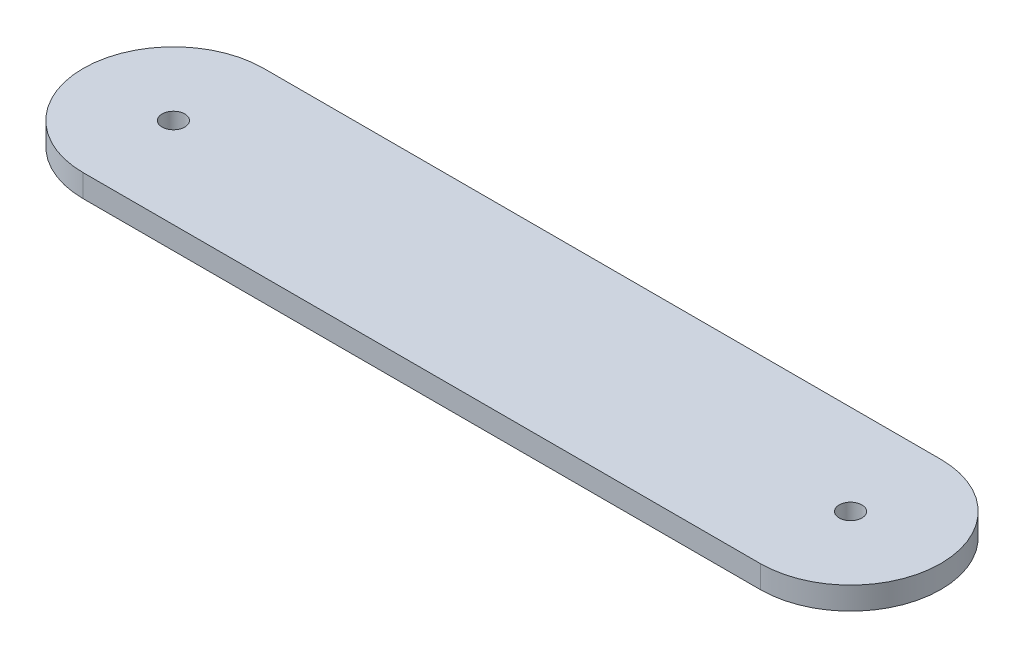
ISO-10303-21;
HEADER;
FILE_DESCRIPTION(('STEP AP214'),'2;1');
FILE_NAME('part.step','',(''),(''),'','','');
FILE_SCHEMA(('AUTOMOTIVE_DESIGN { 1 0 10303 214 1 1 1 1 }'));
ENDSEC;
DATA;
#1=APPLICATION_CONTEXT('core data for automotive mechanical design processes');
#2=APPLICATION_PROTOCOL_DEFINITION('international standard','automotive_design',2000,#1);
#3=PRODUCT_CONTEXT('',#1,'mechanical');
#4=PRODUCT('Part','Part','',(#3));
#5=PRODUCT_RELATED_PRODUCT_CATEGORY('part','',(#4));
#6=PRODUCT_DEFINITION_FORMATION('','',#4);
#7=PRODUCT_DEFINITION_CONTEXT('part definition',#1,'design');
#8=PRODUCT_DEFINITION('design','',#6,#7);
#9=PRODUCT_DEFINITION_SHAPE('','',#8);
#10=(LENGTH_UNIT() NAMED_UNIT(*) SI_UNIT(.MILLI.,.METRE.));
#11=(NAMED_UNIT(*) PLANE_ANGLE_UNIT() SI_UNIT($,.RADIAN.));
#12=(NAMED_UNIT(*) SI_UNIT($,.STERADIAN.) SOLID_ANGLE_UNIT());
#13=UNCERTAINTY_MEASURE_WITH_UNIT(LENGTH_MEASURE(1.E-05),#10,'distance_accuracy_value','');
#14=(GEOMETRIC_REPRESENTATION_CONTEXT(3) GLOBAL_UNCERTAINTY_ASSIGNED_CONTEXT((#13)) GLOBAL_UNIT_ASSIGNED_CONTEXT((#10,
#11,#12)) REPRESENTATION_CONTEXT('',''));
#15=CARTESIAN_POINT('',(0.,0.,0.));
#16=DIRECTION('',(0.,0.,1.));
#17=DIRECTION('',(1.,0.,0.));
#18=AXIS2_PLACEMENT_3D('',#15,#16,#17);
#19=CARTESIAN_POINT('',(-47.625,3.175,0.));
#20=DIRECTION('',(0.,-1.,0.));
#21=DIRECTION('',(0.,0.,-1.));
#22=AXIS2_PLACEMENT_3D('',#19,#20,#21);
#23=CYLINDRICAL_SURFACE('',#22,12.7);
#24=CARTESIAN_POINT('',(-47.625,0.,0.));
#25=DIRECTION('',(0.,1.,0.));
#26=DIRECTION('',(0.,0.,1.));
#27=AXIS2_PLACEMENT_3D('',#24,#25,#26);
#28=CIRCLE('',#27,12.7);
#29=CARTESIAN_POINT('',(-47.625,0.,-12.7));
#30=VERTEX_POINT('',#29);
#31=CARTESIAN_POINT('',(-47.625,0.,12.7));
#32=VERTEX_POINT('',#31);
#33=EDGE_CURVE('E96',#30,#32,#28,.T.);
#34=ORIENTED_EDGE('',*,*,#33,.T.);
#35=DIRECTION('',(0.,-1.,0.));
#36=VECTOR('',#35,1.);
#37=CARTESIAN_POINT('',(-47.625,3.175,12.7));
#38=LINE('',#37,#36);
#39=CARTESIAN_POINT('',(-47.625,3.175,12.7));
#40=VERTEX_POINT('',#39);
#41=EDGE_CURVE('E11',#40,#32,#38,.T.);
#42=ORIENTED_EDGE('',*,*,#41,.F.);
#43=CARTESIAN_POINT('',(-47.625,3.175,0.));
#44=DIRECTION('',(0.,1.,0.));
#45=DIRECTION('',(0.,0.,1.));
#46=AXIS2_PLACEMENT_3D('',#43,#44,#45);
#47=CIRCLE('',#46,12.7);
#48=CARTESIAN_POINT('',(-47.625,3.175,-12.7));
#49=VERTEX_POINT('',#48);
#50=EDGE_CURVE('E84',#49,#40,#47,.T.);
#51=ORIENTED_EDGE('',*,*,#50,.F.);
#52=DIRECTION('',(0.,-1.,0.));
#53=VECTOR('',#52,1.);
#54=CARTESIAN_POINT('',(-47.625,3.175,-12.7));
#55=LINE('',#54,#53);
#56=EDGE_CURVE('E92',#49,#30,#55,.T.);
#57=ORIENTED_EDGE('',*,*,#56,.T.);
#58=EDGE_LOOP('',(#34,#42,#51,#57));
#59=FACE_BOUND('',#58,.T.);
#60=ADVANCED_FACE('F33',(#59),#23,.T.);
#61=CARTESIAN_POINT('',(-47.625,3.175,12.7));
#62=DIRECTION('',(0.,0.,-1.));
#63=DIRECTION('',(-1.,0.,0.));
#64=AXIS2_PLACEMENT_3D('',#61,#62,#63);
#65=PLANE('',#64);
#66=DIRECTION('',(1.,0.,0.));
#67=VECTOR('',#66,1.);
#68=CARTESIAN_POINT('',(-47.625,0.,12.7));
#69=LINE('',#68,#67);
#70=CARTESIAN_POINT('',(47.625,0.,12.7));
#71=VERTEX_POINT('',#70);
#72=EDGE_CURVE('E88',#32,#71,#69,.T.);
#73=ORIENTED_EDGE('',*,*,#72,.T.);
#74=DIRECTION('',(0.,-1.,0.));
#75=VECTOR('',#74,1.);
#76=CARTESIAN_POINT('',(47.625,3.175,12.7));
#77=LINE('',#76,#75);
#78=CARTESIAN_POINT('',(47.625,3.175,12.7));
#79=VERTEX_POINT('',#78);
#80=EDGE_CURVE('E41',#79,#71,#77,.T.);
#81=ORIENTED_EDGE('',*,*,#80,.F.);
#82=DIRECTION('',(1.,0.,0.));
#83=VECTOR('',#82,1.);
#84=CARTESIAN_POINT('',(-47.625,3.175,12.7));
#85=LINE('',#84,#83);
#86=EDGE_CURVE('E79',#40,#79,#85,.T.);
#87=ORIENTED_EDGE('',*,*,#86,.F.);
#88=ORIENTED_EDGE('',*,*,#41,.T.);
#89=EDGE_LOOP('',(#73,#81,#87,#88));
#90=FACE_BOUND('',#89,.T.);
#91=ADVANCED_FACE('F87',(#90),#65,.F.);
#92=CARTESIAN_POINT('',(47.625,3.175,0.));
#93=DIRECTION('',(0.,-1.,0.));
#94=DIRECTION('',(0.,0.,-1.));
#95=AXIS2_PLACEMENT_3D('',#92,#93,#94);
#96=CYLINDRICAL_SURFACE('',#95,12.7);
#97=CARTESIAN_POINT('',(47.625,0.,0.));
#98=DIRECTION('',(0.,1.,0.));
#99=DIRECTION('',(0.,0.,1.));
#100=AXIS2_PLACEMENT_3D('',#97,#98,#99);
#101=CIRCLE('',#100,12.7);
#102=CARTESIAN_POINT('',(47.625,0.,-12.7));
#103=VERTEX_POINT('',#102);
#104=EDGE_CURVE('E66',#71,#103,#101,.T.);
#105=ORIENTED_EDGE('',*,*,#104,.T.);
#106=DIRECTION('',(0.,-1.,0.));
#107=VECTOR('',#106,1.);
#108=CARTESIAN_POINT('',(47.625,3.175,-12.7));
#109=LINE('',#108,#107);
#110=CARTESIAN_POINT('',(47.625,3.175,-12.7));
#111=VERTEX_POINT('',#110);
#112=EDGE_CURVE('E89',#111,#103,#109,.T.);
#113=ORIENTED_EDGE('',*,*,#112,.F.);
#114=CARTESIAN_POINT('',(47.625,3.175,0.));
#115=DIRECTION('',(0.,1.,0.));
#116=DIRECTION('',(0.,0.,1.));
#117=AXIS2_PLACEMENT_3D('',#114,#115,#116);
#118=CIRCLE('',#117,12.7);
#119=EDGE_CURVE('E82',#79,#111,#118,.T.);
#120=ORIENTED_EDGE('',*,*,#119,.F.);
#121=ORIENTED_EDGE('',*,*,#80,.T.);
#122=EDGE_LOOP('',(#105,#113,#120,#121));
#123=FACE_BOUND('',#122,.T.);
#124=ADVANCED_FACE('F90',(#123),#96,.T.);
#125=CARTESIAN_POINT('',(-47.625,3.175,-12.7));
#126=DIRECTION('',(0.,0.,1.));
#127=DIRECTION('',(1.,0.,0.));
#128=AXIS2_PLACEMENT_3D('',#125,#126,#127);
#129=PLANE('',#128);
#130=DIRECTION('',(-1.,0.,0.));
#131=VECTOR('',#130,1.);
#132=CARTESIAN_POINT('',(-47.625,0.,-12.7));
#133=LINE('',#132,#131);
#134=EDGE_CURVE('E72',#103,#30,#133,.T.);
#135=ORIENTED_EDGE('',*,*,#134,.T.);
#136=ORIENTED_EDGE('',*,*,#56,.F.);
#137=DIRECTION('',(-1.,0.,0.));
#138=VECTOR('',#137,1.);
#139=CARTESIAN_POINT('',(-47.625,3.175,-12.7));
#140=LINE('',#139,#138);
#141=EDGE_CURVE('E49',#111,#49,#140,.T.);
#142=ORIENTED_EDGE('',*,*,#141,.F.);
#143=ORIENTED_EDGE('',*,*,#112,.T.);
#144=EDGE_LOOP('',(#135,#136,#142,#143));
#145=FACE_BOUND('',#144,.T.);
#146=ADVANCED_FACE('F104',(#145),#129,.F.);
#147=CARTESIAN_POINT('',(-47.625,3.175,0.));
#148=DIRECTION('',(0.,1.,0.));
#149=DIRECTION('',(0.,0.,1.));
#150=AXIS2_PLACEMENT_3D('',#147,#148,#149);
#151=PLANE('',#150);
#152=CARTESIAN_POINT('',(-47.625,3.175,0.));
#153=DIRECTION('',(0.,1.,0.));
#154=DIRECTION('',(0.,0.,1.));
#155=AXIS2_PLACEMENT_3D('',#152,#153,#154);
#156=CIRCLE('',#155,1.6);
#157=CARTESIAN_POINT('',(-47.625,3.175,1.6));
#158=VERTEX_POINT('',#157);
#159=EDGE_CURVE('E118',#158,#158,#156,.T.);
#160=ORIENTED_EDGE('',*,*,#159,.F.);
#161=EDGE_LOOP('',(#160));
#162=FACE_BOUND('',#161,.T.);
#163=CARTESIAN_POINT('',(47.625,3.175,0.));
#164=DIRECTION('',(0.,1.,0.));
#165=DIRECTION('',(0.,0.,1.));
#166=AXIS2_PLACEMENT_3D('',#163,#164,#165);
#167=CIRCLE('',#166,1.6);
#168=CARTESIAN_POINT('',(47.625,3.175,1.6));
#169=VERTEX_POINT('',#168);
#170=EDGE_CURVE('E112',#169,#169,#167,.T.);
#171=ORIENTED_EDGE('',*,*,#170,.F.);
#172=EDGE_LOOP('',(#171));
#173=FACE_BOUND('',#172,.T.);
#174=ORIENTED_EDGE('',*,*,#50,.T.);
#175=ORIENTED_EDGE('',*,*,#86,.T.);
#176=ORIENTED_EDGE('',*,*,#119,.T.);
#177=ORIENTED_EDGE('',*,*,#141,.T.);
#178=EDGE_LOOP('',(#174,#175,#176,#177));
#179=FACE_BOUND('',#178,.T.);
#180=ADVANCED_FACE('F80',(#162,#173,#179),#151,.T.);
#181=CARTESIAN_POINT('',(-47.625,0.,0.));
#182=DIRECTION('',(0.,1.,0.));
#183=DIRECTION('',(0.,0.,1.));
#184=AXIS2_PLACEMENT_3D('',#181,#182,#183);
#185=PLANE('',#184);
#186=CARTESIAN_POINT('',(-47.625,0.,0.));
#187=DIRECTION('',(0.,1.,0.));
#188=DIRECTION('',(0.,0.,1.));
#189=AXIS2_PLACEMENT_3D('',#186,#187,#188);
#190=CIRCLE('',#189,1.6);
#191=CARTESIAN_POINT('',(-47.625,0.,1.6));
#192=VERTEX_POINT('',#191);
#193=EDGE_CURVE('E115',#192,#192,#190,.T.);
#194=ORIENTED_EDGE('',*,*,#193,.T.);
#195=EDGE_LOOP('',(#194));
#196=FACE_BOUND('',#195,.T.);
#197=CARTESIAN_POINT('',(47.625,0.,0.));
#198=DIRECTION('',(0.,1.,0.));
#199=DIRECTION('',(0.,0.,1.));
#200=AXIS2_PLACEMENT_3D('',#197,#198,#199);
#201=CIRCLE('',#200,1.6);
#202=CARTESIAN_POINT('',(47.625,0.,1.6));
#203=VERTEX_POINT('',#202);
#204=EDGE_CURVE('E99',#203,#203,#201,.T.);
#205=ORIENTED_EDGE('',*,*,#204,.T.);
#206=EDGE_LOOP('',(#205));
#207=FACE_BOUND('',#206,.T.);
#208=ORIENTED_EDGE('',*,*,#33,.F.);
#209=ORIENTED_EDGE('',*,*,#134,.F.);
#210=ORIENTED_EDGE('',*,*,#104,.F.);
#211=ORIENTED_EDGE('',*,*,#72,.F.);
#212=EDGE_LOOP('',(#208,#209,#210,#211));
#213=FACE_BOUND('',#212,.T.);
#214=ADVANCED_FACE('F107',(#196,#207,#213),#185,.F.);
#215=CARTESIAN_POINT('',(47.625,3.175,0.));
#216=DIRECTION('',(0.,1.,0.));
#217=DIRECTION('',(0.,0.,1.));
#218=AXIS2_PLACEMENT_3D('',#215,#216,#217);
#219=CYLINDRICAL_SURFACE('',#218,1.6);
#220=ORIENTED_EDGE('',*,*,#204,.F.);
#221=EDGE_LOOP('',(#220));
#222=FACE_BOUND('',#221,.T.);
#223=ORIENTED_EDGE('',*,*,#170,.T.);
#224=EDGE_LOOP('',(#223));
#225=FACE_BOUND('',#224,.T.);
#226=ADVANCED_FACE('F129',(#222,#225),#219,.F.);
#227=CARTESIAN_POINT('',(-47.625,3.175,0.));
#228=DIRECTION('',(0.,1.,0.));
#229=DIRECTION('',(0.,0.,1.));
#230=AXIS2_PLACEMENT_3D('',#227,#228,#229);
#231=CYLINDRICAL_SURFACE('',#230,1.6);
#232=ORIENTED_EDGE('',*,*,#193,.F.);
#233=EDGE_LOOP('',(#232));
#234=FACE_BOUND('',#233,.T.);
#235=ORIENTED_EDGE('',*,*,#159,.T.);
#236=EDGE_LOOP('',(#235));
#237=FACE_BOUND('',#236,.T.);
#238=ADVANCED_FACE('F122',(#234,#237),#231,.F.);
#239=CLOSED_SHELL('',(#60,#91,#124,#146,#180,#214,#226,#238));
#240=MANIFOLD_SOLID_BREP('B2',#239);
#241=ADVANCED_BREP_SHAPE_REPRESENTATION('',(#18,#240),#14);
#242=SHAPE_DEFINITION_REPRESENTATION(#9,#241);
ENDSEC;
END-ISO-10303-21;
